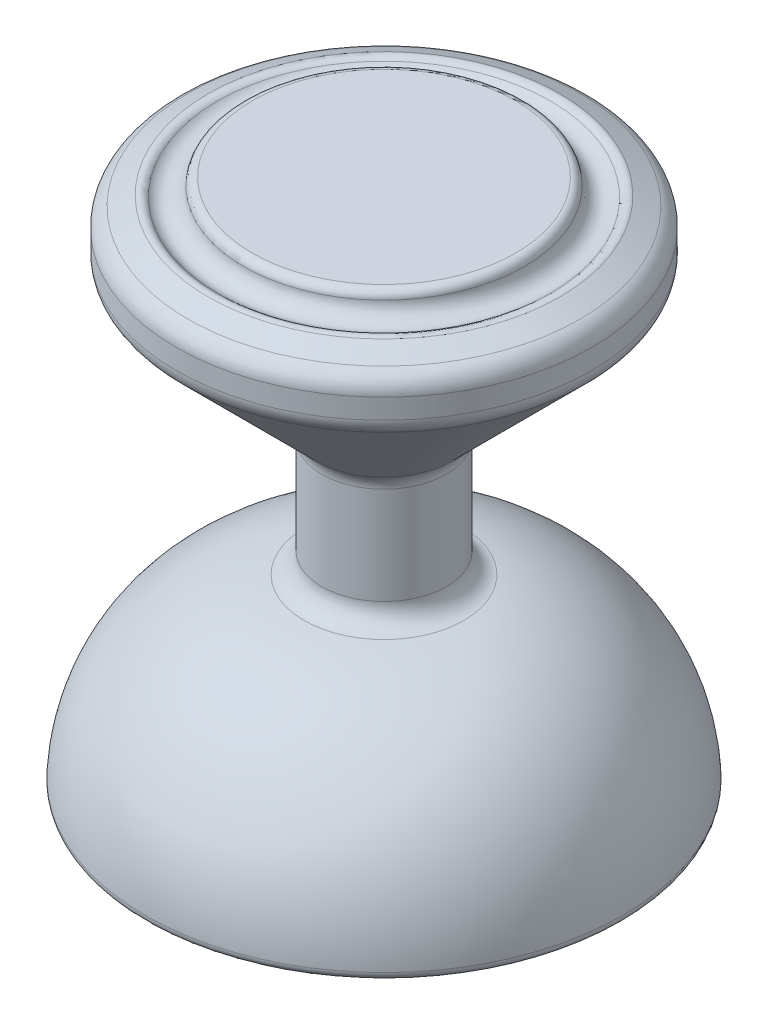
ISO-10303-21;
HEADER;
FILE_DESCRIPTION(('STEP AP214'),'2;1');
FILE_NAME('part.step','',(''),(''),'','','');
FILE_SCHEMA(('AUTOMOTIVE_DESIGN { 1 0 10303 214 1 1 1 1 }'));
ENDSEC;
DATA;
#1=APPLICATION_CONTEXT('core data for automotive mechanical design processes');
#2=APPLICATION_PROTOCOL_DEFINITION('international standard','automotive_design',2000,#1);
#3=PRODUCT_CONTEXT('',#1,'mechanical');
#4=PRODUCT('Part','Part','',(#3));
#5=PRODUCT_RELATED_PRODUCT_CATEGORY('part','',(#4));
#6=PRODUCT_DEFINITION_FORMATION('','',#4);
#7=PRODUCT_DEFINITION_CONTEXT('part definition',#1,'design');
#8=PRODUCT_DEFINITION('design','',#6,#7);
#9=PRODUCT_DEFINITION_SHAPE('','',#8);
#10=(LENGTH_UNIT() NAMED_UNIT(*) SI_UNIT(.MILLI.,.METRE.));
#11=(NAMED_UNIT(*) PLANE_ANGLE_UNIT() SI_UNIT($,.RADIAN.));
#12=(NAMED_UNIT(*) SI_UNIT($,.STERADIAN.) SOLID_ANGLE_UNIT());
#13=UNCERTAINTY_MEASURE_WITH_UNIT(LENGTH_MEASURE(1.E-05),#10,'distance_accuracy_value','');
#14=(GEOMETRIC_REPRESENTATION_CONTEXT(3) GLOBAL_UNCERTAINTY_ASSIGNED_CONTEXT((#13)) GLOBAL_UNIT_ASSIGNED_CONTEXT((#10,
#11,#12)) REPRESENTATION_CONTEXT('',''));
#15=CARTESIAN_POINT('',(0.,0.,0.));
#16=DIRECTION('',(0.,0.,1.));
#17=DIRECTION('',(1.,0.,0.));
#18=AXIS2_PLACEMENT_3D('',#15,#16,#17);
#19=CARTESIAN_POINT('',(0.,6.,0.));
#20=DIRECTION('',(0.,1.,0.));
#21=DIRECTION('',(-1.,0.,0.));
#22=AXIS2_PLACEMENT_3D('',#19,#20,#21);
#23=PLANE('',#22);
#24=DIRECTION('',(1.,0.,0.));
#25=VECTOR('',#24,1.);
#26=CARTESIAN_POINT('',(0.,6.,-0.8));
#27=LINE('',#26,#25);
#28=CARTESIAN_POINT('',(1.25,6.,-0.8));
#29=VERTEX_POINT('',#28);
#30=CARTESIAN_POINT('',(-1.25,6.,-0.8));
#31=VERTEX_POINT('',#30);
#32=EDGE_CURVE('E187',#29,#31,#27,.F.);
#33=ORIENTED_EDGE('',*,*,#32,.T.);
#34=DIRECTION('',(0.,0.,-1.));
#35=VECTOR('',#34,1.);
#36=CARTESIAN_POINT('',(-1.25,6.,0.));
#37=LINE('',#36,#35);
#38=CARTESIAN_POINT('',(-1.25,6.,0.8));
#39=VERTEX_POINT('',#38);
#40=EDGE_CURVE('E189',#31,#39,#37,.F.);
#41=ORIENTED_EDGE('',*,*,#40,.T.);
#42=DIRECTION('',(-1.,0.,0.));
#43=VECTOR('',#42,1.);
#44=CARTESIAN_POINT('',(0.,6.,0.8));
#45=LINE('',#44,#43);
#46=CARTESIAN_POINT('',(1.25,6.,0.8));
#47=VERTEX_POINT('',#46);
#48=EDGE_CURVE('E185',#39,#47,#45,.F.);
#49=ORIENTED_EDGE('',*,*,#48,.T.);
#50=DIRECTION('',(0.,0.,1.));
#51=VECTOR('',#50,1.);
#52=CARTESIAN_POINT('',(1.25,6.,0.));
#53=LINE('',#52,#51);
#54=EDGE_CURVE('E183',#47,#29,#53,.F.);
#55=ORIENTED_EDGE('',*,*,#54,.T.);
#56=EDGE_LOOP('',(#33,#41,#49,#55));
#57=FACE_BOUND('',#56,.T.);
#58=CARTESIAN_POINT('',(0.,6.,0.));
#59=DIRECTION('',(0.,1.,0.));
#60=DIRECTION('',(-1.,0.,0.));
#61=AXIS2_PLACEMENT_3D('',#58,#59,#60);
#62=CIRCLE('',#61,7.64511443183828);
#63=CARTESIAN_POINT('',(-7.64511443183828,6.,0.));
#64=VERTEX_POINT('',#63);
#65=EDGE_CURVE('E141',#64,#64,#62,.F.);
#66=ORIENTED_EDGE('',*,*,#65,.T.);
#67=EDGE_LOOP('',(#66));
#68=FACE_BOUND('',#67,.T.);
#69=ADVANCED_FACE('F41',(#57,#68),#23,.F.);
#70=CARTESIAN_POINT('',(0.,25.5,0.));
#71=DIRECTION('',(0.,1.,0.));
#72=DIRECTION('',(-1.,0.,0.));
#73=AXIS2_PLACEMENT_3D('',#70,#71,#72);
#74=PLANE('',#73);
#75=CARTESIAN_POINT('',(0.,25.5,0.));
#76=DIRECTION('',(0.,1.,0.));
#77=DIRECTION('',(-1.,0.,0.));
#78=AXIS2_PLACEMENT_3D('',#75,#76,#77);
#79=CIRCLE('',#78,6.35322000074884);
#80=CARTESIAN_POINT('',(-6.35322000074884,25.5,0.));
#81=VERTEX_POINT('',#80);
#82=EDGE_CURVE('E153',#81,#81,#79,.T.);
#83=ORIENTED_EDGE('',*,*,#82,.T.);
#84=EDGE_LOOP('',(#83));
#85=FACE_BOUND('',#84,.T.);
#86=ADVANCED_FACE('F225',(#85),#74,.T.);
#87=CARTESIAN_POINT('',(0.,25.1859978680986,0.));
#88=DIRECTION('',(0.,-1.,0.));
#89=DIRECTION('',(1.,0.,0.));
#90=AXIS2_PLACEMENT_3D('',#87,#88,#89);
#91=TOROIDAL_SURFACE('',#90,7.5,0.750000000000001);
#92=CARTESIAN_POINT('',(0.,24.6543002141859,0.));
#93=DIRECTION('',(0.,1.,0.));
#94=DIRECTION('',(-1.,0.,0.));
#95=AXIS2_PLACEMENT_3D('',#92,#93,#94);
#96=CIRCLE('',#95,8.02895898217511);
#97=CARTESIAN_POINT('',(-8.02895898217511,24.6543002141859,0.));
#98=VERTEX_POINT('',#97);
#99=EDGE_CURVE('E150',#98,#98,#96,.T.);
#100=ORIENTED_EDGE('',*,*,#99,.T.);
#101=EDGE_LOOP('',(#100));
#102=FACE_BOUND('',#101,.T.);
#103=CARTESIAN_POINT('',(0.,25.1299123019474,0.));
#104=DIRECTION('',(0.,1.,0.));
#105=DIRECTION('',(-1.,0.,0.));
#106=AXIS2_PLACEMENT_3D('',#103,#104,#105);
#107=CIRCLE('',#106,6.75210000048837);
#108=CARTESIAN_POINT('',(-6.75210000048837,25.1299123019474,0.));
#109=VERTEX_POINT('',#108);
#110=EDGE_CURVE('E147',#109,#109,#107,.F.);
#111=ORIENTED_EDGE('',*,*,#110,.T.);
#112=EDGE_LOOP('',(#111));
#113=FACE_BOUND('',#112,.T.);
#114=ADVANCED_FACE('F228',(#102,#113),#91,.F.);
#115=CARTESIAN_POINT('',(0.,-35.9475010284145,0.));
#116=DIRECTION('',(0.,-1.,0.));
#117=DIRECTION('',(1.,0.,0.));
#118=AXIS2_PLACEMENT_3D('',#115,#116,#117);
#119=DEGENERATE_TOROIDAL_SURFACE('',#118,19.8578615556423,66.9715967872027,.F.);
#120=CARTESIAN_POINT('',(0.,24.2769188725248,0.));
#121=DIRECTION('',(0.,-1.,0.));
#122=DIRECTION('',(1.,0.,0.));
#123=AXIS2_PLACEMENT_3D('',#120,#121,#122);
#124=CIRCLE('',#123,9.43742857473536);
#125=CARTESIAN_POINT('',(9.43742857473536,24.2769188725248,0.));
#126=VERTEX_POINT('',#125);
#127=EDGE_CURVE('E177',#126,#126,#124,.F.);
#128=ORIENTED_EDGE('',*,*,#127,.T.);
#129=EDGE_LOOP('',(#128));
#130=FACE_BOUND('',#129,.T.);
#131=CARTESIAN_POINT('',(0.,24.7331543443068,0.));
#132=DIRECTION('',(0.,-1.,0.));
#133=DIRECTION('',(1.,0.,0.));
#134=AXIS2_PLACEMENT_3D('',#131,#132,#133);
#135=CIRCLE('',#134,8.48032539703142);
#136=CARTESIAN_POINT('',(8.48032539703142,24.7331543443068,0.));
#137=VERTEX_POINT('',#136);
#138=EDGE_CURVE('E144',#137,#137,#135,.T.);
#139=ORIENTED_EDGE('',*,*,#138,.T.);
#140=EDGE_LOOP('',(#139));
#141=FACE_BOUND('',#140,.T.);
#142=ADVANCED_FACE('F234',(#130,#141),#119,.F.);
#143=CARTESIAN_POINT('',(0.,0.,0.));
#144=DIRECTION('',(0.,-1.,0.));
#145=DIRECTION('',(1.,0.,0.));
#146=AXIS2_PLACEMENT_3D('',#143,#144,#145);
#147=CYLINDRICAL_SURFACE('',#146,10.);
#148=CARTESIAN_POINT('',(0.,22.4142135623731,0.));
#149=DIRECTION('',(0.,1.,0.));
#150=DIRECTION('',(-1.,0.,0.));
#151=AXIS2_PLACEMENT_3D('',#148,#149,#150);
#152=CIRCLE('',#151,10.);
#153=CARTESIAN_POINT('',(-10.,22.4142135623731,0.));
#154=VERTEX_POINT('',#153);
#155=EDGE_CURVE('E174',#154,#154,#152,.T.);
#156=ORIENTED_EDGE('',*,*,#155,.T.);
#157=EDGE_LOOP('',(#156));
#158=FACE_BOUND('',#157,.T.);
#159=CARTESIAN_POINT('',(0.,23.3776657146182,0.));
#160=DIRECTION('',(0.,1.,0.));
#161=DIRECTION('',(-1.,0.,0.));
#162=AXIS2_PLACEMENT_3D('',#159,#160,#161);
#163=CIRCLE('',#162,10.);
#164=CARTESIAN_POINT('',(-10.,23.3776657146182,0.));
#165=VERTEX_POINT('',#164);
#166=EDGE_CURVE('E171',#165,#165,#163,.F.);
#167=ORIENTED_EDGE('',*,*,#166,.T.);
#168=EDGE_LOOP('',(#167));
#169=FACE_BOUND('',#168,.T.);
#170=ADVANCED_FACE('F244',(#158,#169),#147,.T.);
#171=CARTESIAN_POINT('',(0.,22.,0.));
#172=DIRECTION('',(0.,1.,0.));
#173=DIRECTION('',(-1.,0.,0.));
#174=AXIS2_PLACEMENT_3D('',#171,#172,#173);
#175=CONICAL_SURFACE('',#174,10.,0.785398163397446);
#176=CARTESIAN_POINT('',(0.,15.2928932188135,0.));
#177=DIRECTION('',(0.,-1.,0.));
#178=DIRECTION('',(1.,0.,0.));
#179=AXIS2_PLACEMENT_3D('',#176,#177,#178);
#180=CIRCLE('',#179,3.29289321881345);
#181=CARTESIAN_POINT('',(3.29289321881345,15.2928932188135,0.));
#182=VERTEX_POINT('',#181);
#183=EDGE_CURVE('E168',#182,#182,#180,.F.);
#184=ORIENTED_EDGE('',*,*,#183,.T.);
#185=EDGE_LOOP('',(#184));
#186=FACE_BOUND('',#185,.T.);
#187=CARTESIAN_POINT('',(0.,21.7071067811866,0.));
#188=DIRECTION('',(0.,1.,0.));
#189=DIRECTION('',(-1.,0.,0.));
#190=AXIS2_PLACEMENT_3D('',#187,#188,#189);
#191=CIRCLE('',#190,9.70710678118655);
#192=CARTESIAN_POINT('',(-9.70710678118655,21.7071067811866,0.));
#193=VERTEX_POINT('',#192);
#194=EDGE_CURVE('E165',#193,#193,#191,.F.);
#195=ORIENTED_EDGE('',*,*,#194,.T.);
#196=EDGE_LOOP('',(#195));
#197=FACE_BOUND('',#196,.T.);
#198=ADVANCED_FACE('F251',(#186,#197),#175,.T.);
#199=CARTESIAN_POINT('',(0.,0.,0.));
#200=DIRECTION('',(0.,-1.,0.));
#201=DIRECTION('',(1.,0.,0.));
#202=AXIS2_PLACEMENT_3D('',#199,#200,#201);
#203=CYLINDRICAL_SURFACE('',#202,3.);
#204=CARTESIAN_POINT('',(0.,9.89949493661165,0.));
#205=DIRECTION('',(0.,-1.,0.));
#206=DIRECTION('',(1.,0.,0.));
#207=AXIS2_PLACEMENT_3D('',#204,#205,#206);
#208=CIRCLE('',#207,3.);
#209=CARTESIAN_POINT('',(3.,9.89949493661165,0.));
#210=VERTEX_POINT('',#209);
#211=EDGE_CURVE('E162',#210,#210,#208,.F.);
#212=ORIENTED_EDGE('',*,*,#211,.T.);
#213=EDGE_LOOP('',(#212));
#214=FACE_BOUND('',#213,.T.);
#215=CARTESIAN_POINT('',(0.,14.5857864376269,0.));
#216=DIRECTION('',(0.,-1.,0.));
#217=DIRECTION('',(1.,0.,0.));
#218=AXIS2_PLACEMENT_3D('',#215,#216,#217);
#219=CIRCLE('',#218,3.);
#220=CARTESIAN_POINT('',(3.,14.5857864376269,0.));
#221=VERTEX_POINT('',#220);
#222=EDGE_CURVE('E159',#221,#221,#219,.T.);
#223=ORIENTED_EDGE('',*,*,#222,.T.);
#224=EDGE_LOOP('',(#223));
#225=FACE_BOUND('',#224,.T.);
#226=ADVANCED_FACE('F255',(#214,#225),#203,.T.);
#227=CARTESIAN_POINT('',(0.,0.,0.));
#228=DIRECTION('',(0.,-1.,0.));
#229=DIRECTION('',(1.,0.,0.));
#230=AXIS2_PLACEMENT_3D('',#227,#228,#229);
#231=DEGENERATE_TOROIDAL_SURFACE('',#230,2.48529411764706,9.01470588235294,.T.);
#232=CARTESIAN_POINT('',(0.,8.91099911327893,0.));
#233=DIRECTION('',(0.,-1.,0.));
#234=DIRECTION('',(1.,0.,0.));
#235=AXIS2_PLACEMENT_3D('',#232,#233,#234);
#236=CIRCLE('',#235,3.84875183553598);
#237=CARTESIAN_POINT('',(3.84875183553598,8.91099911327893,0.));
#238=VERTEX_POINT('',#237);
#239=EDGE_CURVE('E156',#238,#238,#236,.T.);
#240=ORIENTED_EDGE('',*,*,#239,.T.);
#241=EDGE_LOOP('',(#240));
#242=FACE_BOUND('',#241,.T.);
#243=CARTESIAN_POINT('',(0.,0.418572891771927,0.));
#244=DIRECTION('',(0.,-1.,0.));
#245=DIRECTION('',(1.,0.,0.));
#246=AXIS2_PLACEMENT_3D('',#243,#244,#245);
#247=CIRCLE('',#246,11.4902771203852);
#248=CARTESIAN_POINT('',(11.4902771203852,0.418572891771927,0.));
#249=VERTEX_POINT('',#248);
#250=EDGE_CURVE('E138',#249,#249,#247,.F.);
#251=ORIENTED_EDGE('',*,*,#250,.T.);
#252=EDGE_LOOP('',(#251));
#253=FACE_BOUND('',#252,.T.);
#254=ADVANCED_FACE('F259',(#242,#253),#231,.T.);
#255=CARTESIAN_POINT('',(0.,0.,0.));
#256=DIRECTION('',(0.,-1.,0.));
#257=DIRECTION('',(1.,0.,0.));
#258=AXIS2_PLACEMENT_3D('',#255,#256,#257);
#259=PLANE('',#258);
#260=CARTESIAN_POINT('',(0.,0.,0.));
#261=DIRECTION('',(0.,-1.,0.));
#262=DIRECTION('',(1.,0.,0.));
#263=AXIS2_PLACEMENT_3D('',#260,#261,#262);
#264=CIRCLE('',#263,10.8904874578686);
#265=CARTESIAN_POINT('',(10.8904874578686,0.,0.));
#266=VERTEX_POINT('',#265);
#267=EDGE_CURVE('E135',#266,#266,#264,.F.);
#268=ORIENTED_EDGE('',*,*,#267,.T.);
#269=EDGE_LOOP('',(#268));
#270=FACE_BOUND('',#269,.T.);
#271=CARTESIAN_POINT('',(0.,0.,0.));
#272=DIRECTION('',(0.,-1.,0.));
#273=DIRECTION('',(1.,0.,0.));
#274=AXIS2_PLACEMENT_3D('',#271,#272,#273);
#275=CIRCLE('',#274,11.0907085434284);
#276=CARTESIAN_POINT('',(11.0907085434284,0.,0.));
#277=VERTEX_POINT('',#276);
#278=EDGE_CURVE('E132',#277,#277,#275,.T.);
#279=ORIENTED_EDGE('',*,*,#278,.T.);
#280=EDGE_LOOP('',(#279));
#281=FACE_BOUND('',#280,.T.);
#282=ADVANCED_FACE('F263',(#270,#281),#259,.T.);
#283=CARTESIAN_POINT('',(0.,0.,0.));
#284=DIRECTION('',(0.,-1.,0.));
#285=DIRECTION('',(1.,0.,0.));
#286=AXIS2_PLACEMENT_3D('',#283,#284,#285);
#287=DEGENERATE_TOROIDAL_SURFACE('',#286,2.48529411764706,8.01470588235294,.T.);
#288=CARTESIAN_POINT('',(0.,0.380985669346374,0.));
#289=DIRECTION('',(0.,-1.,0.));
#290=DIRECTION('',(1.,0.,0.));
#291=AXIS2_PLACEMENT_3D('',#288,#289,#290);
#292=CIRCLE('',#291,10.4909396444222);
#293=CARTESIAN_POINT('',(10.4909396444222,0.380985669346374,0.));
#294=VERTEX_POINT('',#293);
#295=EDGE_CURVE('E129',#294,#294,#292,.T.);
#296=ORIENTED_EDGE('',*,*,#295,.T.);
#297=EDGE_LOOP('',(#296));
#298=FACE_BOUND('',#297,.T.);
#299=CARTESIAN_POINT('',(0.,5.89416763229046,0.));
#300=DIRECTION('',(0.,-1.,0.));
#301=DIRECTION('',(1.,0.,0.));
#302=AXIS2_PLACEMENT_3D('',#299,#300,#301);
#303=CIRCLE('',#302,7.91615945413647);
#304=CARTESIAN_POINT('',(7.91615945413647,5.89416763229046,0.));
#305=VERTEX_POINT('',#304);
#306=EDGE_CURVE('E123',#305,#305,#303,.F.);
#307=ORIENTED_EDGE('',*,*,#306,.T.);
#308=EDGE_LOOP('',(#307));
#309=FACE_BOUND('',#308,.T.);
#310=ADVANCED_FACE('F221',(#298,#309),#287,.F.);
#311=CARTESIAN_POINT('',(1.05,9.8,0.6));
#312=DIRECTION('',(1.,0.,0.));
#313=DIRECTION('',(0.,0.,-1.));
#314=AXIS2_PLACEMENT_3D('',#311,#312,#313);
#315=PLANE('',#314);
#316=DIRECTION('',(0.,-1.,0.));
#317=VECTOR('',#316,1.);
#318=CARTESIAN_POINT('',(1.05,9.8,-0.6));
#319=LINE('',#318,#317);
#320=CARTESIAN_POINT('',(1.05,9.8,-0.6));
#321=VERTEX_POINT('',#320);
#322=CARTESIAN_POINT('',(1.05,6.2,-0.6));
#323=VERTEX_POINT('',#322);
#324=EDGE_CURVE('E121',#321,#323,#319,.T.);
#325=ORIENTED_EDGE('',*,*,#324,.T.);
#326=DIRECTION('',(0.,0.,1.));
#327=VECTOR('',#326,1.);
#328=CARTESIAN_POINT('',(1.05,6.2,0.6));
#329=LINE('',#328,#327);
#330=CARTESIAN_POINT('',(1.05,6.2,0.6));
#331=VERTEX_POINT('',#330);
#332=EDGE_CURVE('E11',#323,#331,#329,.T.);
#333=ORIENTED_EDGE('',*,*,#332,.T.);
#334=DIRECTION('',(0.,-1.,0.));
#335=VECTOR('',#334,1.);
#336=CARTESIAN_POINT('',(1.05,9.8,0.6));
#337=LINE('',#336,#335);
#338=CARTESIAN_POINT('',(1.05,9.8,0.6));
#339=VERTEX_POINT('',#338);
#340=EDGE_CURVE('E93',#339,#331,#337,.T.);
#341=ORIENTED_EDGE('',*,*,#340,.F.);
#342=DIRECTION('',(0.,0.,1.));
#343=VECTOR('',#342,1.);
#344=CARTESIAN_POINT('',(1.05,9.8,0.6));
#345=LINE('',#344,#343);
#346=EDGE_CURVE('E97',#321,#339,#345,.T.);
#347=ORIENTED_EDGE('',*,*,#346,.F.);
#348=EDGE_LOOP('',(#325,#333,#341,#347));
#349=FACE_BOUND('',#348,.T.);
#350=ADVANCED_FACE('F95',(#349),#315,.F.);
#351=CARTESIAN_POINT('',(-1.05,9.8,-0.6));
#352=DIRECTION('',(0.,0.,-1.));
#353=DIRECTION('',(-1.,0.,0.));
#354=AXIS2_PLACEMENT_3D('',#351,#352,#353);
#355=PLANE('',#354);
#356=DIRECTION('',(0.,-1.,0.));
#357=VECTOR('',#356,1.);
#358=CARTESIAN_POINT('',(-1.05,9.8,-0.6));
#359=LINE('',#358,#357);
#360=CARTESIAN_POINT('',(-1.05,9.8,-0.6));
#361=VERTEX_POINT('',#360);
#362=CARTESIAN_POINT('',(-1.05,6.2,-0.6));
#363=VERTEX_POINT('',#362);
#364=EDGE_CURVE('E124',#361,#363,#359,.T.);
#365=ORIENTED_EDGE('',*,*,#364,.T.);
#366=DIRECTION('',(1.,0.,0.));
#367=VECTOR('',#366,1.);
#368=CARTESIAN_POINT('',(-1.05,6.2,-0.6));
#369=LINE('',#368,#367);
#370=EDGE_CURVE('E64',#363,#323,#369,.T.);
#371=ORIENTED_EDGE('',*,*,#370,.T.);
#372=ORIENTED_EDGE('',*,*,#324,.F.);
#373=DIRECTION('',(1.,0.,0.));
#374=VECTOR('',#373,1.);
#375=CARTESIAN_POINT('',(-1.05,9.8,-0.6));
#376=LINE('',#375,#374);
#377=EDGE_CURVE('E102',#361,#321,#376,.T.);
#378=ORIENTED_EDGE('',*,*,#377,.F.);
#379=EDGE_LOOP('',(#365,#371,#372,#378));
#380=FACE_BOUND('',#379,.T.);
#381=ADVANCED_FACE('F213',(#380),#355,.F.);
#382=CARTESIAN_POINT('',(-1.05,9.8,0.6));
#383=DIRECTION('',(-1.,0.,0.));
#384=DIRECTION('',(0.,0.,1.));
#385=AXIS2_PLACEMENT_3D('',#382,#383,#384);
#386=PLANE('',#385);
#387=DIRECTION('',(0.,-1.,0.));
#388=VECTOR('',#387,1.);
#389=CARTESIAN_POINT('',(-1.05,9.8,0.6));
#390=LINE('',#389,#388);
#391=CARTESIAN_POINT('',(-1.05,9.8,0.6));
#392=VERTEX_POINT('',#391);
#393=CARTESIAN_POINT('',(-1.05,6.2,0.6));
#394=VERTEX_POINT('',#393);
#395=EDGE_CURVE('E101',#392,#394,#390,.T.);
#396=ORIENTED_EDGE('',*,*,#395,.T.);
#397=DIRECTION('',(0.,0.,-1.));
#398=VECTOR('',#397,1.);
#399=CARTESIAN_POINT('',(-1.05,6.2,0.6));
#400=LINE('',#399,#398);
#401=EDGE_CURVE('E180',#394,#363,#400,.T.);
#402=ORIENTED_EDGE('',*,*,#401,.T.);
#403=ORIENTED_EDGE('',*,*,#364,.F.);
#404=DIRECTION('',(0.,0.,-1.));
#405=VECTOR('',#404,1.);
#406=CARTESIAN_POINT('',(-1.05,9.8,0.6));
#407=LINE('',#406,#405);
#408=EDGE_CURVE('E111',#392,#361,#407,.T.);
#409=ORIENTED_EDGE('',*,*,#408,.F.);
#410=EDGE_LOOP('',(#396,#402,#403,#409));
#411=FACE_BOUND('',#410,.T.);
#412=ADVANCED_FACE('F212',(#411),#386,.F.);
#413=CARTESIAN_POINT('',(-1.05,9.8,0.6));
#414=DIRECTION('',(0.,0.,1.));
#415=DIRECTION('',(1.,0.,0.));
#416=AXIS2_PLACEMENT_3D('',#413,#414,#415);
#417=PLANE('',#416);
#418=ORIENTED_EDGE('',*,*,#340,.T.);
#419=DIRECTION('',(-1.,0.,0.));
#420=VECTOR('',#419,1.);
#421=CARTESIAN_POINT('',(-1.05,6.2,0.6));
#422=LINE('',#421,#420);
#423=EDGE_CURVE('E50',#331,#394,#422,.T.);
#424=ORIENTED_EDGE('',*,*,#423,.T.);
#425=ORIENTED_EDGE('',*,*,#395,.F.);
#426=DIRECTION('',(-1.,0.,0.));
#427=VECTOR('',#426,1.);
#428=CARTESIAN_POINT('',(-1.05,9.8,0.6));
#429=LINE('',#428,#427);
#430=EDGE_CURVE('E105',#339,#392,#429,.T.);
#431=ORIENTED_EDGE('',*,*,#430,.F.);
#432=EDGE_LOOP('',(#418,#424,#425,#431));
#433=FACE_BOUND('',#432,.T.);
#434=ADVANCED_FACE('F106',(#433),#417,.F.);
#435=CARTESIAN_POINT('',(0.,9.8,0.));
#436=DIRECTION('',(0.,-1.,0.));
#437=DIRECTION('',(0.,0.,-1.));
#438=AXIS2_PLACEMENT_3D('',#435,#436,#437);
#439=PLANE('',#438);
#440=ORIENTED_EDGE('',*,*,#346,.T.);
#441=ORIENTED_EDGE('',*,*,#430,.T.);
#442=ORIENTED_EDGE('',*,*,#408,.T.);
#443=ORIENTED_EDGE('',*,*,#377,.T.);
#444=EDGE_LOOP('',(#440,#441,#442,#443));
#445=FACE_BOUND('',#444,.T.);
#446=ADVANCED_FACE('F113',(#445),#439,.T.);
#447=CARTESIAN_POINT('',(0.,0.399999999999991,0.));
#448=DIRECTION('',(0.,-1.,0.));
#449=DIRECTION('',(1.,0.,0.));
#450=AXIS2_PLACEMENT_3D('',#447,#448,#449);
#451=TOROIDAL_SURFACE('',#450,10.8904874578686,0.4);
#452=ORIENTED_EDGE('',*,*,#267,.F.);
#453=EDGE_LOOP('',(#452));
#454=FACE_BOUND('',#453,.T.);
#455=ORIENTED_EDGE('',*,*,#295,.F.);
#456=EDGE_LOOP('',(#455));
#457=FACE_BOUND('',#456,.T.);
#458=ADVANCED_FACE('F289',(#454,#457),#451,.T.);
#459=CARTESIAN_POINT('',(0.,0.399999999999991,0.));
#460=DIRECTION('',(0.,-1.,0.));
#461=DIRECTION('',(1.,0.,0.));
#462=AXIS2_PLACEMENT_3D('',#459,#460,#461);
#463=TOROIDAL_SURFACE('',#462,11.0907085434284,0.4);
#464=ORIENTED_EDGE('',*,*,#250,.F.);
#465=EDGE_LOOP('',(#464));
#466=FACE_BOUND('',#465,.T.);
#467=ORIENTED_EDGE('',*,*,#278,.F.);
#468=EDGE_LOOP('',(#467));
#469=FACE_BOUND('',#468,.T.);
#470=ADVANCED_FACE('F279',(#466,#469),#463,.T.);
#471=CARTESIAN_POINT('',(0.,5.6,0.));
#472=DIRECTION('',(0.,1.,0.));
#473=DIRECTION('',(-1.,0.,0.));
#474=AXIS2_PLACEMENT_3D('',#471,#472,#473);
#475=TOROIDAL_SURFACE('',#474,7.64511443183828,0.4);
#476=ORIENTED_EDGE('',*,*,#306,.F.);
#477=EDGE_LOOP('',(#476));
#478=FACE_BOUND('',#477,.T.);
#479=ORIENTED_EDGE('',*,*,#65,.F.);
#480=EDGE_LOOP('',(#479));
#481=FACE_BOUND('',#480,.T.);
#482=ADVANCED_FACE('F275',(#478,#481),#475,.F.);
#483=CARTESIAN_POINT('',(0.,24.3707281320991,0.));
#484=DIRECTION('',(0.,1.,0.));
#485=DIRECTION('',(-1.,0.,0.));
#486=AXIS2_PLACEMENT_3D('',#483,#484,#485);
#487=TOROIDAL_SURFACE('',#486,8.31107043933515,0.4);
#488=ORIENTED_EDGE('',*,*,#99,.F.);
#489=EDGE_LOOP('',(#488));
#490=FACE_BOUND('',#489,.T.);
#491=ORIENTED_EDGE('',*,*,#138,.F.);
#492=EDGE_LOOP('',(#491));
#493=FACE_BOUND('',#492,.T.);
#494=ADVANCED_FACE('F278',(#490,#493),#487,.T.);
#495=CARTESIAN_POINT('',(0.,25.1,0.));
#496=DIRECTION('',(0.,-1.,0.));
#497=DIRECTION('',(1.,0.,0.));
#498=AXIS2_PLACEMENT_3D('',#495,#496,#497);
#499=TOROIDAL_SURFACE('',#498,6.35322000074884,0.4);
#500=ORIENTED_EDGE('',*,*,#82,.F.);
#501=EDGE_LOOP('',(#500));
#502=FACE_BOUND('',#501,.T.);
#503=ORIENTED_EDGE('',*,*,#110,.F.);
#504=EDGE_LOOP('',(#503));
#505=FACE_BOUND('',#504,.T.);
#506=ADVANCED_FACE('F286',(#502,#505),#499,.T.);
#507=CARTESIAN_POINT('',(0.,9.89949493661165,0.));
#508=DIRECTION('',(0.,-1.,0.));
#509=DIRECTION('',(1.,0.,0.));
#510=AXIS2_PLACEMENT_3D('',#507,#508,#509);
#511=TOROIDAL_SURFACE('',#510,4.,1.);
#512=ORIENTED_EDGE('',*,*,#211,.F.);
#513=EDGE_LOOP('',(#512));
#514=FACE_BOUND('',#513,.T.);
#515=ORIENTED_EDGE('',*,*,#239,.F.);
#516=EDGE_LOOP('',(#515));
#517=FACE_BOUND('',#516,.T.);
#518=ADVANCED_FACE('F295',(#514,#517),#511,.F.);
#519=CARTESIAN_POINT('',(0.,14.5857864376269,0.));
#520=DIRECTION('',(0.,-1.,0.));
#521=DIRECTION('',(1.,0.,0.));
#522=AXIS2_PLACEMENT_3D('',#519,#520,#521);
#523=TOROIDAL_SURFACE('',#522,4.,1.);
#524=ORIENTED_EDGE('',*,*,#183,.F.);
#525=EDGE_LOOP('',(#524));
#526=FACE_BOUND('',#525,.T.);
#527=ORIENTED_EDGE('',*,*,#222,.F.);
#528=EDGE_LOOP('',(#527));
#529=FACE_BOUND('',#528,.T.);
#530=ADVANCED_FACE('F299',(#526,#529),#523,.F.);
#531=CARTESIAN_POINT('',(0.,22.4142135623731,0.));
#532=DIRECTION('',(0.,1.,0.));
#533=DIRECTION('',(-1.,0.,0.));
#534=AXIS2_PLACEMENT_3D('',#531,#532,#533);
#535=TOROIDAL_SURFACE('',#534,9.,1.);
#536=ORIENTED_EDGE('',*,*,#155,.F.);
#537=EDGE_LOOP('',(#536));
#538=FACE_BOUND('',#537,.T.);
#539=ORIENTED_EDGE('',*,*,#194,.F.);
#540=EDGE_LOOP('',(#539));
#541=FACE_BOUND('',#540,.T.);
#542=ADVANCED_FACE('F303',(#538,#541),#535,.T.);
#543=CARTESIAN_POINT('',(0.,23.3776657146182,0.));
#544=DIRECTION('',(0.,1.,0.));
#545=DIRECTION('',(-1.,0.,0.));
#546=AXIS2_PLACEMENT_3D('',#543,#544,#545);
#547=TOROIDAL_SURFACE('',#546,9.,1.);
#548=ORIENTED_EDGE('',*,*,#127,.F.);
#549=EDGE_LOOP('',(#548));
#550=FACE_BOUND('',#549,.T.);
#551=ORIENTED_EDGE('',*,*,#166,.F.);
#552=EDGE_LOOP('',(#551));
#553=FACE_BOUND('',#552,.T.);
#554=ADVANCED_FACE('F307',(#550,#553),#547,.T.);
#555=CARTESIAN_POINT('',(1.25,6.2,0.6));
#556=DIRECTION('',(0.,0.,1.));
#557=DIRECTION('',(1.,0.,0.));
#558=AXIS2_PLACEMENT_3D('',#555,#556,#557);
#559=CYLINDRICAL_SURFACE('',#558,0.2);
#560=CARTESIAN_POINT('',(1.25,6.2,-0.8));
#561=DIRECTION('',(0.707106781186547,0.,0.707106781186547));
#562=DIRECTION('',(0.707106781186547,0.,-0.707106781186547));
#563=AXIS2_PLACEMENT_3D('',#560,#561,#562);
#564=ELLIPSE('',#563,0.282842712474619,0.2);
#565=EDGE_CURVE('E117',#29,#323,#564,.F.);
#566=ORIENTED_EDGE('',*,*,#565,.F.);
#567=ORIENTED_EDGE('',*,*,#54,.F.);
#568=CARTESIAN_POINT('',(1.25,6.2,0.8));
#569=DIRECTION('',(-0.707106781186547,0.,0.707106781186547));
#570=DIRECTION('',(-0.707106781186547,0.,-0.707106781186547));
#571=AXIS2_PLACEMENT_3D('',#568,#569,#570);
#572=ELLIPSE('',#571,0.282842712474619,0.2);
#573=EDGE_CURVE('E45',#331,#47,#572,.T.);
#574=ORIENTED_EDGE('',*,*,#573,.F.);
#575=ORIENTED_EDGE('',*,*,#332,.F.);
#576=EDGE_LOOP('',(#566,#567,#574,#575));
#577=FACE_BOUND('',#576,.T.);
#578=ADVANCED_FACE('F43',(#577),#559,.T.);
#579=CARTESIAN_POINT('',(-1.05,6.2,0.8));
#580=DIRECTION('',(-1.,0.,0.));
#581=DIRECTION('',(0.,-1.,0.));
#582=AXIS2_PLACEMENT_3D('',#579,#580,#581);
#583=CYLINDRICAL_SURFACE('',#582,0.2);
#584=ORIENTED_EDGE('',*,*,#573,.T.);
#585=ORIENTED_EDGE('',*,*,#48,.F.);
#586=CARTESIAN_POINT('',(-1.25,6.2,0.8));
#587=DIRECTION('',(-0.707106781186547,0.,-0.707106781186548));
#588=DIRECTION('',(0.707106781186548,0.,-0.707106781186547));
#589=AXIS2_PLACEMENT_3D('',#586,#587,#588);
#590=ELLIPSE('',#589,0.282842712474619,0.2);
#591=EDGE_CURVE('E196',#394,#39,#590,.T.);
#592=ORIENTED_EDGE('',*,*,#591,.F.);
#593=ORIENTED_EDGE('',*,*,#423,.F.);
#594=EDGE_LOOP('',(#584,#585,#592,#593));
#595=FACE_BOUND('',#594,.T.);
#596=ADVANCED_FACE('F209',(#595),#583,.T.);
#597=CARTESIAN_POINT('',(-1.05,6.2,-0.8));
#598=DIRECTION('',(1.,0.,0.));
#599=DIRECTION('',(0.,1.,0.));
#600=AXIS2_PLACEMENT_3D('',#597,#598,#599);
#601=CYLINDRICAL_SURFACE('',#600,0.2);
#602=ORIENTED_EDGE('',*,*,#565,.T.);
#603=ORIENTED_EDGE('',*,*,#370,.F.);
#604=CARTESIAN_POINT('',(-1.25,6.2,-0.8));
#605=DIRECTION('',(0.707106781186548,0.,-0.707106781186547));
#606=DIRECTION('',(-0.707106781186547,0.,-0.707106781186548));
#607=AXIS2_PLACEMENT_3D('',#604,#605,#606);
#608=ELLIPSE('',#607,0.282842712474619,0.2);
#609=EDGE_CURVE('E194',#31,#363,#608,.F.);
#610=ORIENTED_EDGE('',*,*,#609,.F.);
#611=ORIENTED_EDGE('',*,*,#32,.F.);
#612=EDGE_LOOP('',(#602,#603,#610,#611));
#613=FACE_BOUND('',#612,.T.);
#614=ADVANCED_FACE('F201',(#613),#601,.T.);
#615=CARTESIAN_POINT('',(-1.25,6.2,0.6));
#616=DIRECTION('',(0.,0.,-1.));
#617=DIRECTION('',(-1.,0.,0.));
#618=AXIS2_PLACEMENT_3D('',#615,#616,#617);
#619=CYLINDRICAL_SURFACE('',#618,0.2);
#620=ORIENTED_EDGE('',*,*,#591,.T.);
#621=ORIENTED_EDGE('',*,*,#40,.F.);
#622=ORIENTED_EDGE('',*,*,#609,.T.);
#623=ORIENTED_EDGE('',*,*,#401,.F.);
#624=EDGE_LOOP('',(#620,#621,#622,#623));
#625=FACE_BOUND('',#624,.T.);
#626=ADVANCED_FACE('F312',(#625),#619,.T.);
#627=CLOSED_SHELL('',(#69,#86,#114,#142,#170,#198,#226,#254,#282,#310,#350,#381,#412,#434,#446,
#458,#470,#482,#494,#506,#518,#530,#542,#554,#578,#596,#614,#626));
#628=MANIFOLD_SOLID_BREP('B2',#627);
#629=ADVANCED_BREP_SHAPE_REPRESENTATION('',(#18,#628),#14);
#630=SHAPE_DEFINITION_REPRESENTATION(#9,#629);
ENDSEC;
END-ISO-10303-21;
